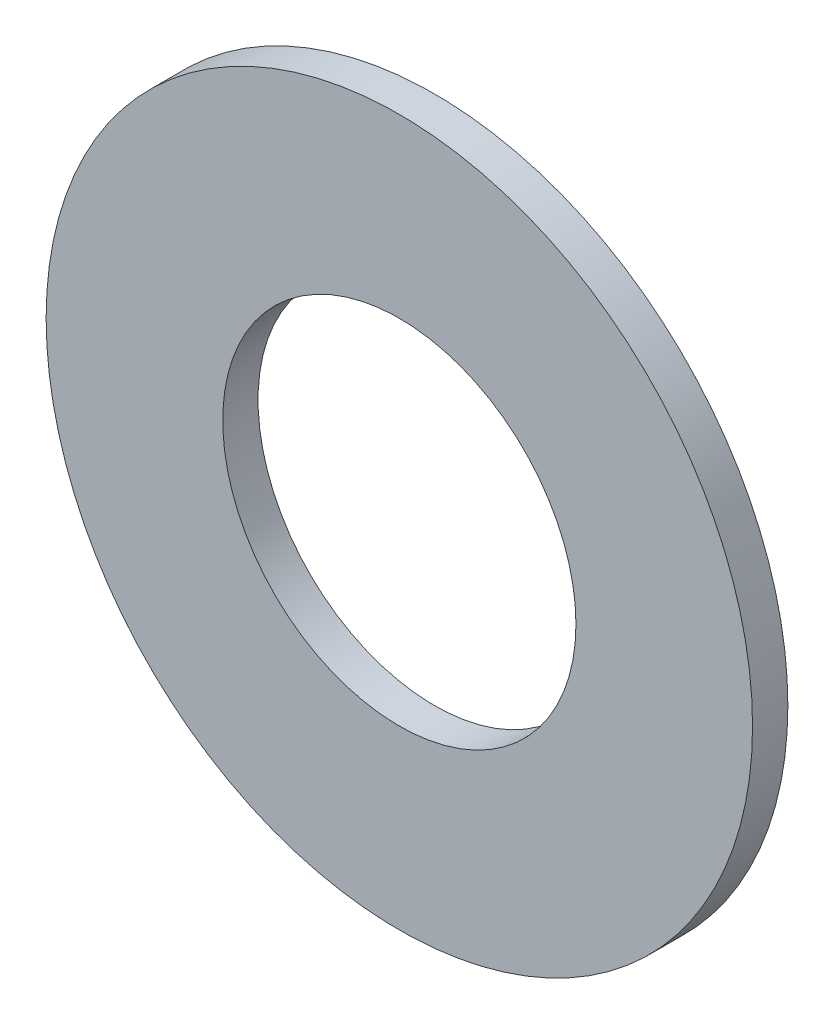
ISO-10303-21;
HEADER;
FILE_DESCRIPTION(('STEP AP214'),'2;1');
FILE_NAME('part.step','',(''),(''),'','','');
FILE_SCHEMA(('AUTOMOTIVE_DESIGN { 1 0 10303 214 1 1 1 1 }'));
ENDSEC;
DATA;
#1=APPLICATION_CONTEXT('core data for automotive mechanical design processes');
#2=APPLICATION_PROTOCOL_DEFINITION('international standard','automotive_design',2000,#1);
#3=PRODUCT_CONTEXT('',#1,'mechanical');
#4=PRODUCT('Part','Part','',(#3));
#5=PRODUCT_RELATED_PRODUCT_CATEGORY('part','',(#4));
#6=PRODUCT_DEFINITION_FORMATION('','',#4);
#7=PRODUCT_DEFINITION_CONTEXT('part definition',#1,'design');
#8=PRODUCT_DEFINITION('design','',#6,#7);
#9=PRODUCT_DEFINITION_SHAPE('','',#8);
#10=(LENGTH_UNIT() NAMED_UNIT(*) SI_UNIT(.MILLI.,.METRE.));
#11=(NAMED_UNIT(*) PLANE_ANGLE_UNIT() SI_UNIT($,.RADIAN.));
#12=(NAMED_UNIT(*) SI_UNIT($,.STERADIAN.) SOLID_ANGLE_UNIT());
#13=UNCERTAINTY_MEASURE_WITH_UNIT(LENGTH_MEASURE(1.E-05),#10,'distance_accuracy_value','');
#14=(GEOMETRIC_REPRESENTATION_CONTEXT(3) GLOBAL_UNCERTAINTY_ASSIGNED_CONTEXT((#13)) GLOBAL_UNIT_ASSIGNED_CONTEXT((#10,
#11,#12)) REPRESENTATION_CONTEXT('',''));
#15=CARTESIAN_POINT('',(0.,0.,0.));
#16=DIRECTION('',(0.,0.,1.));
#17=DIRECTION('',(1.,0.,0.));
#18=AXIS2_PLACEMENT_3D('',#15,#16,#17);
#19=CARTESIAN_POINT('',(0.,0.,1.));
#20=DIRECTION('',(0.,0.,-1.));
#21=DIRECTION('',(-1.,0.,0.));
#22=AXIS2_PLACEMENT_3D('',#19,#20,#21);
#23=CYLINDRICAL_SURFACE('',#22,10.);
#24=CARTESIAN_POINT('',(0.,0.,1.));
#25=DIRECTION('',(0.,0.,1.));
#26=DIRECTION('',(1.,0.,0.));
#27=AXIS2_PLACEMENT_3D('',#24,#25,#26);
#28=CIRCLE('',#27,10.);
#29=CARTESIAN_POINT('',(10.,0.,1.));
#30=VERTEX_POINT('',#29);
#31=EDGE_CURVE('E10',#30,#30,#28,.T.);
#32=ORIENTED_EDGE('',*,*,#31,.F.);
#33=EDGE_LOOP('',(#32));
#34=FACE_BOUND('',#33,.T.);
#35=CARTESIAN_POINT('',(0.,0.,0.));
#36=DIRECTION('',(0.,0.,1.));
#37=DIRECTION('',(1.,0.,0.));
#38=AXIS2_PLACEMENT_3D('',#35,#36,#37);
#39=CIRCLE('',#38,10.);
#40=CARTESIAN_POINT('',(10.,0.,0.));
#41=VERTEX_POINT('',#40);
#42=EDGE_CURVE('E38',#41,#41,#39,.T.);
#43=ORIENTED_EDGE('',*,*,#42,.T.);
#44=EDGE_LOOP('',(#43));
#45=FACE_BOUND('',#44,.T.);
#46=ADVANCED_FACE('F31',(#34,#45),#23,.T.);
#47=CARTESIAN_POINT('',(0.,0.,1.));
#48=DIRECTION('',(0.,0.,1.));
#49=DIRECTION('',(1.,0.,0.));
#50=AXIS2_PLACEMENT_3D('',#47,#48,#49);
#51=PLANE('',#50);
#52=CARTESIAN_POINT('',(0.,0.,1.));
#53=DIRECTION('',(0.,0.,1.));
#54=DIRECTION('',(1.,0.,0.));
#55=AXIS2_PLACEMENT_3D('',#52,#53,#54);
#56=CIRCLE('',#55,5.);
#57=CARTESIAN_POINT('',(5.,0.,1.));
#58=VERTEX_POINT('',#57);
#59=EDGE_CURVE('E44',#58,#58,#56,.T.);
#60=ORIENTED_EDGE('',*,*,#59,.F.);
#61=EDGE_LOOP('',(#60));
#62=FACE_BOUND('',#61,.T.);
#63=ORIENTED_EDGE('',*,*,#31,.T.);
#64=EDGE_LOOP('',(#63));
#65=FACE_BOUND('',#64,.T.);
#66=ADVANCED_FACE('F60',(#62,#65),#51,.T.);
#67=CARTESIAN_POINT('',(0.,0.,0.));
#68=DIRECTION('',(0.,0.,1.));
#69=DIRECTION('',(1.,0.,0.));
#70=AXIS2_PLACEMENT_3D('',#67,#68,#69);
#71=PLANE('',#70);
#72=CARTESIAN_POINT('',(0.,0.,0.));
#73=DIRECTION('',(0.,0.,1.));
#74=DIRECTION('',(1.,0.,0.));
#75=AXIS2_PLACEMENT_3D('',#72,#73,#74);
#76=CIRCLE('',#75,5.);
#77=CARTESIAN_POINT('',(5.,0.,0.));
#78=VERTEX_POINT('',#77);
#79=EDGE_CURVE('E34',#78,#78,#76,.T.);
#80=ORIENTED_EDGE('',*,*,#79,.T.);
#81=EDGE_LOOP('',(#80));
#82=FACE_BOUND('',#81,.T.);
#83=ORIENTED_EDGE('',*,*,#42,.F.);
#84=EDGE_LOOP('',(#83));
#85=FACE_BOUND('',#84,.T.);
#86=ADVANCED_FACE('F51',(#82,#85),#71,.F.);
#87=CARTESIAN_POINT('',(0.,0.,-3.));
#88=DIRECTION('',(0.,0.,1.));
#89=DIRECTION('',(1.,0.,0.));
#90=AXIS2_PLACEMENT_3D('',#87,#88,#89);
#91=CYLINDRICAL_SURFACE('',#90,5.);
#92=ORIENTED_EDGE('',*,*,#59,.T.);
#93=EDGE_LOOP('',(#92));
#94=FACE_BOUND('',#93,.T.);
#95=ORIENTED_EDGE('',*,*,#79,.F.);
#96=EDGE_LOOP('',(#95));
#97=FACE_BOUND('',#96,.T.);
#98=ADVANCED_FACE('F54',(#94,#97),#91,.F.);
#99=CLOSED_SHELL('',(#46,#66,#86,#98));
#100=MANIFOLD_SOLID_BREP('B2',#99);
#101=ADVANCED_BREP_SHAPE_REPRESENTATION('',(#18,#100),#14);
#102=SHAPE_DEFINITION_REPRESENTATION(#9,#101);
ENDSEC;
END-ISO-10303-21;
